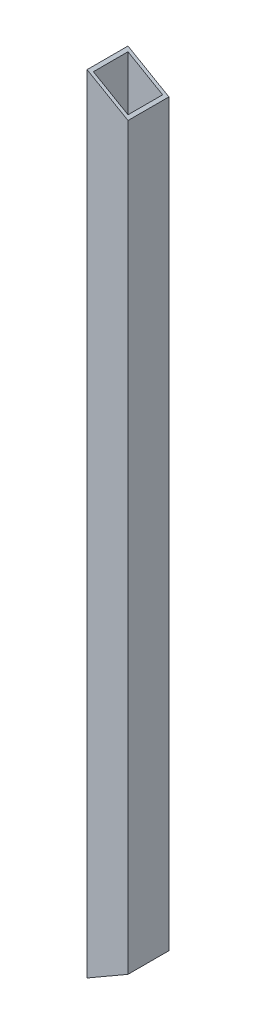
ISO-10303-21;
HEADER;
FILE_DESCRIPTION(('STEP AP214'),'2;1');
FILE_NAME('part.step','',(''),(''),'','','');
FILE_SCHEMA(('AUTOMOTIVE_DESIGN { 1 0 10303 214 1 1 1 1 }'));
ENDSEC;
DATA;
#1=APPLICATION_CONTEXT('core data for automotive mechanical design processes');
#2=APPLICATION_PROTOCOL_DEFINITION('international standard','automotive_design',2000,#1);
#3=PRODUCT_CONTEXT('',#1,'mechanical');
#4=PRODUCT('Part','Part','',(#3));
#5=PRODUCT_RELATED_PRODUCT_CATEGORY('part','',(#4));
#6=PRODUCT_DEFINITION_FORMATION('','',#4);
#7=PRODUCT_DEFINITION_CONTEXT('part definition',#1,'design');
#8=PRODUCT_DEFINITION('design','',#6,#7);
#9=PRODUCT_DEFINITION_SHAPE('','',#8);
#10=(LENGTH_UNIT() NAMED_UNIT(*) SI_UNIT(.MILLI.,.METRE.));
#11=(NAMED_UNIT(*) PLANE_ANGLE_UNIT() SI_UNIT($,.RADIAN.));
#12=(NAMED_UNIT(*) SI_UNIT($,.STERADIAN.) SOLID_ANGLE_UNIT());
#13=UNCERTAINTY_MEASURE_WITH_UNIT(LENGTH_MEASURE(1.E-05),#10,'distance_accuracy_value','');
#14=(GEOMETRIC_REPRESENTATION_CONTEXT(3) GLOBAL_UNCERTAINTY_ASSIGNED_CONTEXT((#13)) GLOBAL_UNIT_ASSIGNED_CONTEXT((#10,
#11,#12)) REPRESENTATION_CONTEXT('',''));
#15=CARTESIAN_POINT('',(0.,0.,0.));
#16=DIRECTION('',(0.,0.,1.));
#17=DIRECTION('',(1.,0.,0.));
#18=AXIS2_PLACEMENT_3D('',#15,#16,#17);
#19=CARTESIAN_POINT('',(-5.11717464296441,250.,-5.46943206191018));
#20=DIRECTION('',(0.,0.,1.));
#21=DIRECTION('',(1.,0.,0.));
#22=AXIS2_PLACEMENT_3D('',#19,#20,#21);
#23=PLANE('',#22);
#24=DIRECTION('',(0.,-1.,0.));
#25=VECTOR('',#24,1.);
#26=CARTESIAN_POINT('',(-5.11717464296441,250.,-5.46943206191018));
#27=LINE('',#26,#25);
#28=CARTESIAN_POINT('',(-5.11717464296441,249.42264973081,-5.46943206191018));
#29=VERTEX_POINT('',#28);
#30=CARTESIAN_POINT('',(-5.11717464296441,0.577350269189612,-5.46943206191018));
#31=VERTEX_POINT('',#30);
#32=EDGE_CURVE('E162',#29,#31,#27,.T.);
#33=ORIENTED_EDGE('',*,*,#32,.T.);
#34=DIRECTION('',(0.866025403784439,0.5,0.));
#35=VECTOR('',#34,1.);
#36=CARTESIAN_POINT('',(102.88600083009,62.9330127018922,-5.46943206191018));
#37=LINE('',#36,#35);
#38=CARTESIAN_POINT('',(5.8828253570356,6.92820323027554,-5.46943206191018));
#39=VERTEX_POINT('',#38);
#40=EDGE_CURVE('E11',#31,#39,#37,.T.);
#41=ORIENTED_EDGE('',*,*,#40,.T.);
#42=DIRECTION('',(0.,-1.,0.));
#43=VECTOR('',#42,1.);
#44=CARTESIAN_POINT('',(5.88282535703559,250.,-5.46943206191018));
#45=LINE('',#44,#43);
#46=CARTESIAN_POINT('',(5.88282535703559,243.071796769725,-5.46943206191018));
#47=VERTEX_POINT('',#46);
#48=EDGE_CURVE('E155',#47,#39,#45,.T.);
#49=ORIENTED_EDGE('',*,*,#48,.F.);
#50=DIRECTION('',(0.866025403784438,-0.500000000000002,0.));
#51=VECTOR('',#50,1.);
#52=CARTESIAN_POINT('',(-5.36717464296439,249.566987298108,-5.46943206191018));
#53=LINE('',#52,#51);
#54=EDGE_CURVE('E47',#29,#47,#53,.T.);
#55=ORIENTED_EDGE('',*,*,#54,.F.);
#56=EDGE_LOOP('',(#33,#41,#49,#55));
#57=FACE_BOUND('',#56,.T.);
#58=ADVANCED_FACE('F38',(#57),#23,.T.);
#59=CARTESIAN_POINT('',(5.88282535703559,250.,-5.46943206191018));
#60=DIRECTION('',(-1.,0.,0.));
#61=DIRECTION('',(0.,0.,1.));
#62=AXIS2_PLACEMENT_3D('',#59,#60,#61);
#63=PLANE('',#62);
#64=ORIENTED_EDGE('',*,*,#48,.T.);
#65=DIRECTION('',(0.,0.,1.));
#66=VECTOR('',#65,1.);
#67=CARTESIAN_POINT('',(5.88282535703559,6.92820323027551,-5.46943206191018));
#68=LINE('',#67,#66);
#69=CARTESIAN_POINT('',(5.88282535703559,6.92820323027551,5.53056793808982));
#70=VERTEX_POINT('',#69);
#71=EDGE_CURVE('E195',#39,#70,#68,.T.);
#72=ORIENTED_EDGE('',*,*,#71,.T.);
#73=DIRECTION('',(0.,-1.,0.));
#74=VECTOR('',#73,1.);
#75=CARTESIAN_POINT('',(5.88282535703559,250.,5.53056793808982));
#76=LINE('',#75,#74);
#77=CARTESIAN_POINT('',(5.88282535703559,243.071796769725,5.53056793808982));
#78=VERTEX_POINT('',#77);
#79=EDGE_CURVE('E157',#78,#70,#76,.T.);
#80=ORIENTED_EDGE('',*,*,#79,.F.);
#81=DIRECTION('',(0.,0.,1.));
#82=VECTOR('',#81,1.);
#83=CARTESIAN_POINT('',(5.88282535703559,243.071796769725,-5.46943206191018));
#84=LINE('',#83,#82);
#85=EDGE_CURVE('E125',#47,#78,#84,.T.);
#86=ORIENTED_EDGE('',*,*,#85,.F.);
#87=EDGE_LOOP('',(#64,#72,#80,#86));
#88=FACE_BOUND('',#87,.T.);
#89=ADVANCED_FACE('F153',(#88),#63,.T.);
#90=CARTESIAN_POINT('',(-5.1171746429644,250.,5.53056793808982));
#91=DIRECTION('',(0.,0.,-1.));
#92=DIRECTION('',(-1.,0.,0.));
#93=AXIS2_PLACEMENT_3D('',#90,#91,#92);
#94=PLANE('',#93);
#95=ORIENTED_EDGE('',*,*,#79,.T.);
#96=DIRECTION('',(-0.866025403784439,-0.5,0.));
#97=VECTOR('',#96,1.);
#98=CARTESIAN_POINT('',(102.88600083009,62.9330127018922,5.53056793808982));
#99=LINE('',#98,#97);
#100=CARTESIAN_POINT('',(-5.11717464296441,0.577350269189612,5.53056793808982));
#101=VERTEX_POINT('',#100);
#102=EDGE_CURVE('E198',#70,#101,#99,.T.);
#103=ORIENTED_EDGE('',*,*,#102,.T.);
#104=DIRECTION('',(0.,-1.,0.));
#105=VECTOR('',#104,1.);
#106=CARTESIAN_POINT('',(-5.1171746429644,250.,5.53056793808982));
#107=LINE('',#106,#105);
#108=CARTESIAN_POINT('',(-5.1171746429644,249.42264973081,5.53056793808982));
#109=VERTEX_POINT('',#108);
#110=EDGE_CURVE('E166',#109,#101,#107,.T.);
#111=ORIENTED_EDGE('',*,*,#110,.F.);
#112=DIRECTION('',(-0.866025403784438,0.500000000000002,0.));
#113=VECTOR('',#112,1.);
#114=CARTESIAN_POINT('',(-5.36717464296439,249.566987298108,5.53056793808982));
#115=LINE('',#114,#113);
#116=EDGE_CURVE('E159',#78,#109,#115,.T.);
#117=ORIENTED_EDGE('',*,*,#116,.F.);
#118=EDGE_LOOP('',(#95,#103,#111,#117));
#119=FACE_BOUND('',#118,.T.);
#120=ADVANCED_FACE('F208',(#119),#94,.T.);
#121=CARTESIAN_POINT('',(-5.11717464296441,250.,-5.46943206191018));
#122=DIRECTION('',(1.,0.,0.));
#123=DIRECTION('',(0.,0.,-1.));
#124=AXIS2_PLACEMENT_3D('',#121,#122,#123);
#125=PLANE('',#124);
#126=ORIENTED_EDGE('',*,*,#110,.T.);
#127=DIRECTION('',(0.,0.,-1.));
#128=VECTOR('',#127,1.);
#129=CARTESIAN_POINT('',(-5.11717464296441,0.577350269189619,-5.46943206191016));
#130=LINE('',#129,#128);
#131=EDGE_CURVE('E168',#101,#31,#130,.T.);
#132=ORIENTED_EDGE('',*,*,#131,.T.);
#133=ORIENTED_EDGE('',*,*,#32,.F.);
#134=DIRECTION('',(0.,0.,-1.));
#135=VECTOR('',#134,1.);
#136=CARTESIAN_POINT('',(-5.11717464296441,249.42264973081,-5.46943206191018));
#137=LINE('',#136,#135);
#138=EDGE_CURVE('E62',#109,#29,#137,.T.);
#139=ORIENTED_EDGE('',*,*,#138,.F.);
#140=EDGE_LOOP('',(#126,#132,#133,#139));
#141=FACE_BOUND('',#140,.T.);
#142=ADVANCED_FACE('F204',(#141),#125,.T.);
#143=CARTESIAN_POINT('',(106.723881812314,184.851185679903,-6.46943206191018));
#144=DIRECTION('',(-0.500000000000002,-0.866025403784438,0.));
#145=DIRECTION('',(0.866025403784438,-0.500000000000002,0.));
#146=AXIS2_PLACEMENT_3D('',#143,#144,#145);
#147=PLANE('',#146);
#148=ORIENTED_EDGE('',*,*,#138,.T.);
#149=ORIENTED_EDGE('',*,*,#54,.T.);
#150=ORIENTED_EDGE('',*,*,#85,.T.);
#151=ORIENTED_EDGE('',*,*,#116,.T.);
#152=EDGE_LOOP('',(#148,#149,#150,#151));
#153=FACE_BOUND('',#152,.T.);
#154=DIRECTION('',(0.866025403784438,-0.500000000000002,0.));
#155=VECTOR('',#154,1.);
#156=CARTESIAN_POINT('',(106.723881812314,184.851185679903,6.53056793808982));
#157=LINE('',#156,#155);
#158=CARTESIAN_POINT('',(-6.1171746429644,250.,6.53056793808982));
#159=VERTEX_POINT('',#158);
#160=CARTESIAN_POINT('',(6.88282535703559,242.494446500535,6.53056793808982));
#161=VERTEX_POINT('',#160);
#162=EDGE_CURVE('E181',#159,#161,#157,.T.);
#163=ORIENTED_EDGE('',*,*,#162,.T.);
#164=DIRECTION('',(0.,0.,1.));
#165=VECTOR('',#164,1.);
#166=CARTESIAN_POINT('',(6.88282535703559,242.494446500535,-6.46943206191018));
#167=LINE('',#166,#165);
#168=CARTESIAN_POINT('',(6.8828253570356,242.494446500535,-6.46943206191018));
#169=VERTEX_POINT('',#168);
#170=EDGE_CURVE('E54',#169,#161,#167,.T.);
#171=ORIENTED_EDGE('',*,*,#170,.F.);
#172=DIRECTION('',(0.866025403784438,-0.500000000000002,0.));
#173=VECTOR('',#172,1.);
#174=CARTESIAN_POINT('',(106.723881812314,184.851185679903,-6.46943206191018));
#175=LINE('',#174,#173);
#176=CARTESIAN_POINT('',(-6.1171746429644,250.,-6.46943206191018));
#177=VERTEX_POINT('',#176);
#178=EDGE_CURVE('E128',#177,#169,#175,.T.);
#179=ORIENTED_EDGE('',*,*,#178,.F.);
#180=DIRECTION('',(0.,0.,1.));
#181=VECTOR('',#180,1.);
#182=CARTESIAN_POINT('',(-6.11717464296441,250.,-6.46943206191018));
#183=LINE('',#182,#181);
#184=EDGE_CURVE('E136',#177,#159,#183,.T.);
#185=ORIENTED_EDGE('',*,*,#184,.T.);
#186=EDGE_LOOP('',(#163,#171,#179,#185));
#187=FACE_BOUND('',#186,.T.);
#188=ADVANCED_FACE('F144',(#153,#187),#147,.F.);
#189=CARTESIAN_POINT('',(-1.5292936607411,2.64881432009659,-6.46943206191018));
#190=DIRECTION('',(0.5,-0.866025403784439,0.));
#191=DIRECTION('',(0.866025403784439,0.5,0.));
#192=AXIS2_PLACEMENT_3D('',#189,#190,#191);
#193=PLANE('',#192);
#194=ORIENTED_EDGE('',*,*,#102,.F.);
#195=ORIENTED_EDGE('',*,*,#71,.F.);
#196=ORIENTED_EDGE('',*,*,#40,.F.);
#197=ORIENTED_EDGE('',*,*,#131,.F.);
#198=EDGE_LOOP('',(#194,#195,#196,#197));
#199=FACE_BOUND('',#198,.T.);
#200=DIRECTION('',(0.866025403784439,0.5,0.));
#201=VECTOR('',#200,1.);
#202=CARTESIAN_POINT('',(-1.5292936607411,2.64881432009659,6.53056793808982));
#203=LINE('',#202,#201);
#204=CARTESIAN_POINT('',(-6.1171746429644,0.,6.53056793808982));
#205=VERTEX_POINT('',#204);
#206=CARTESIAN_POINT('',(6.88282535703559,7.50555349946513,6.53056793808982));
#207=VERTEX_POINT('',#206);
#208=EDGE_CURVE('E115',#205,#207,#203,.T.);
#209=ORIENTED_EDGE('',*,*,#208,.F.);
#210=DIRECTION('',(0.,0.,1.));
#211=VECTOR('',#210,1.);
#212=CARTESIAN_POINT('',(-6.11717464296441,0.,-6.46943206191018));
#213=LINE('',#212,#211);
#214=CARTESIAN_POINT('',(-6.11717464296441,0.,-6.46943206191018));
#215=VERTEX_POINT('',#214);
#216=EDGE_CURVE('E109',#215,#205,#213,.T.);
#217=ORIENTED_EDGE('',*,*,#216,.F.);
#218=DIRECTION('',(0.866025403784439,0.5,0.));
#219=VECTOR('',#218,1.);
#220=CARTESIAN_POINT('',(-1.5292936607411,2.64881432009659,-6.46943206191018));
#221=LINE('',#220,#219);
#222=CARTESIAN_POINT('',(6.88282535703559,7.50555349946513,-6.46943206191018));
#223=VERTEX_POINT('',#222);
#224=EDGE_CURVE('E103',#215,#223,#221,.T.);
#225=ORIENTED_EDGE('',*,*,#224,.T.);
#226=DIRECTION('',(0.,0.,1.));
#227=VECTOR('',#226,1.);
#228=CARTESIAN_POINT('',(6.88282535703559,7.50555349946513,-6.46943206191018));
#229=LINE('',#228,#227);
#230=EDGE_CURVE('E106',#223,#207,#229,.T.);
#231=ORIENTED_EDGE('',*,*,#230,.T.);
#232=EDGE_LOOP('',(#209,#217,#225,#231));
#233=FACE_BOUND('',#232,.T.);
#234=ADVANCED_FACE('F105',(#199,#233),#193,.T.);
#235=CARTESIAN_POINT('',(-6.1171746429644,250.,6.53056793808982));
#236=DIRECTION('',(0.,0.,-1.));
#237=DIRECTION('',(-1.,0.,0.));
#238=AXIS2_PLACEMENT_3D('',#235,#236,#237);
#239=PLANE('',#238);
#240=ORIENTED_EDGE('',*,*,#208,.T.);
#241=DIRECTION('',(0.,-1.,0.));
#242=VECTOR('',#241,1.);
#243=CARTESIAN_POINT('',(6.88282535703559,250.,6.53056793808982));
#244=LINE('',#243,#242);
#245=EDGE_CURVE('E123',#161,#207,#244,.T.);
#246=ORIENTED_EDGE('',*,*,#245,.F.);
#247=ORIENTED_EDGE('',*,*,#162,.F.);
#248=DIRECTION('',(0.,-1.,0.));
#249=VECTOR('',#248,1.);
#250=CARTESIAN_POINT('',(-6.1171746429644,250.,6.53056793808982));
#251=LINE('',#250,#249);
#252=EDGE_CURVE('E134',#159,#205,#251,.T.);
#253=ORIENTED_EDGE('',*,*,#252,.T.);
#254=EDGE_LOOP('',(#240,#246,#247,#253));
#255=FACE_BOUND('',#254,.T.);
#256=ADVANCED_FACE('F183',(#255),#239,.F.);
#257=CARTESIAN_POINT('',(6.88282535703559,250.,-6.46943206191018));
#258=DIRECTION('',(-1.,0.,0.));
#259=DIRECTION('',(0.,0.,1.));
#260=AXIS2_PLACEMENT_3D('',#257,#258,#259);
#261=PLANE('',#260);
#262=ORIENTED_EDGE('',*,*,#230,.F.);
#263=DIRECTION('',(0.,-1.,0.));
#264=VECTOR('',#263,1.);
#265=CARTESIAN_POINT('',(6.88282535703559,250.,-6.46943206191018));
#266=LINE('',#265,#264);
#267=EDGE_CURVE('E121',#169,#223,#266,.T.);
#268=ORIENTED_EDGE('',*,*,#267,.F.);
#269=ORIENTED_EDGE('',*,*,#170,.T.);
#270=ORIENTED_EDGE('',*,*,#245,.T.);
#271=EDGE_LOOP('',(#262,#268,#269,#270));
#272=FACE_BOUND('',#271,.T.);
#273=ADVANCED_FACE('F120',(#272),#261,.F.);
#274=CARTESIAN_POINT('',(-6.11717464296441,250.,-6.46943206191018));
#275=DIRECTION('',(0.,0.,1.));
#276=DIRECTION('',(1.,0.,0.));
#277=AXIS2_PLACEMENT_3D('',#274,#275,#276);
#278=PLANE('',#277);
#279=ORIENTED_EDGE('',*,*,#224,.F.);
#280=DIRECTION('',(0.,-1.,0.));
#281=VECTOR('',#280,1.);
#282=CARTESIAN_POINT('',(-6.11717464296441,250.,-6.46943206191018));
#283=LINE('',#282,#281);
#284=EDGE_CURVE('E130',#177,#215,#283,.T.);
#285=ORIENTED_EDGE('',*,*,#284,.F.);
#286=ORIENTED_EDGE('',*,*,#178,.T.);
#287=ORIENTED_EDGE('',*,*,#267,.T.);
#288=EDGE_LOOP('',(#279,#285,#286,#287));
#289=FACE_BOUND('',#288,.T.);
#290=ADVANCED_FACE('F127',(#289),#278,.F.);
#291=CARTESIAN_POINT('',(-6.11717464296441,250.,-6.46943206191018));
#292=DIRECTION('',(1.,0.,0.));
#293=DIRECTION('',(0.,0.,-1.));
#294=AXIS2_PLACEMENT_3D('',#291,#292,#293);
#295=PLANE('',#294);
#296=ORIENTED_EDGE('',*,*,#216,.T.);
#297=ORIENTED_EDGE('',*,*,#252,.F.);
#298=ORIENTED_EDGE('',*,*,#184,.F.);
#299=ORIENTED_EDGE('',*,*,#284,.T.);
#300=EDGE_LOOP('',(#296,#297,#298,#299));
#301=FACE_BOUND('',#300,.T.);
#302=ADVANCED_FACE('F40',(#301),#295,.F.);
#303=CLOSED_SHELL('',(#58,#89,#120,#142,#188,#234,#256,#273,#290,#302));
#304=MANIFOLD_SOLID_BREP('B2',#303);
#305=ADVANCED_BREP_SHAPE_REPRESENTATION('',(#18,#304),#14);
#306=SHAPE_DEFINITION_REPRESENTATION(#9,#305);
ENDSEC;
END-ISO-10303-21;
